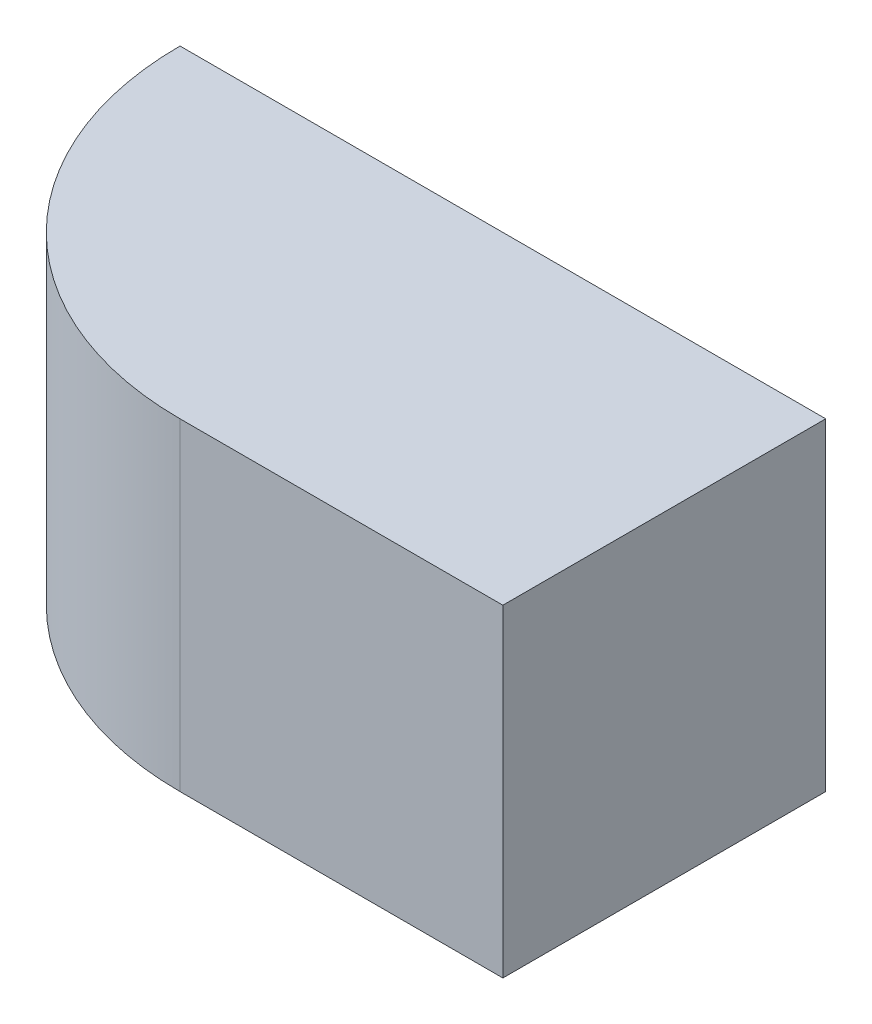
ISO-10303-21;
HEADER;
FILE_DESCRIPTION(('STEP AP214'),'2;1');
FILE_NAME('part.step','',(''),(''),'','','');
FILE_SCHEMA(('AUTOMOTIVE_DESIGN { 1 0 10303 214 1 1 1 1 }'));
ENDSEC;
DATA;
#1=APPLICATION_CONTEXT('core data for automotive mechanical design processes');
#2=APPLICATION_PROTOCOL_DEFINITION('international standard','automotive_design',2000,#1);
#3=PRODUCT_CONTEXT('',#1,'mechanical');
#4=PRODUCT('Part','Part','',(#3));
#5=PRODUCT_RELATED_PRODUCT_CATEGORY('part','',(#4));
#6=PRODUCT_DEFINITION_FORMATION('','',#4);
#7=PRODUCT_DEFINITION_CONTEXT('part definition',#1,'design');
#8=PRODUCT_DEFINITION('design','',#6,#7);
#9=PRODUCT_DEFINITION_SHAPE('','',#8);
#10=(LENGTH_UNIT() NAMED_UNIT(*) SI_UNIT(.MILLI.,.METRE.));
#11=(NAMED_UNIT(*) PLANE_ANGLE_UNIT() SI_UNIT($,.RADIAN.));
#12=(NAMED_UNIT(*) SI_UNIT($,.STERADIAN.) SOLID_ANGLE_UNIT());
#13=UNCERTAINTY_MEASURE_WITH_UNIT(LENGTH_MEASURE(1.E-05),#10,'distance_accuracy_value','');
#14=(GEOMETRIC_REPRESENTATION_CONTEXT(3) GLOBAL_UNCERTAINTY_ASSIGNED_CONTEXT((#13)) GLOBAL_UNIT_ASSIGNED_CONTEXT((#10,
#11,#12)) REPRESENTATION_CONTEXT('',''));
#15=CARTESIAN_POINT('',(0.,0.,0.));
#16=DIRECTION('',(0.,0.,1.));
#17=DIRECTION('',(1.,0.,0.));
#18=AXIS2_PLACEMENT_3D('',#15,#16,#17);
#19=CARTESIAN_POINT('',(-2.00000002980232,-1.75000013038516,2.));
#20=DIRECTION('',(0.,0.,1.));
#21=DIRECTION('',(1.,0.,0.));
#22=AXIS2_PLACEMENT_3D('',#19,#20,#21);
#23=PLANE('',#22);
#24=DIRECTION('',(-1.,0.,0.));
#25=VECTOR('',#24,1.);
#26=CARTESIAN_POINT('',(-1.50000002235174,-2.00000013411045,2.));
#27=LINE('',#26,#25);
#28=CARTESIAN_POINT('',(-1.50000002235174,-2.00000013411045,2.));
#29=VERTEX_POINT('',#28);
#30=CARTESIAN_POINT('',(-2.5000000372529,-2.00000013411045,2.));
#31=VERTEX_POINT('',#30);
#32=EDGE_CURVE('E74',#29,#31,#27,.T.);
#33=ORIENTED_EDGE('',*,*,#32,.T.);
#34=DIRECTION('',(0.,1.,0.));
#35=VECTOR('',#34,1.);
#36=CARTESIAN_POINT('',(-2.5000000372529,-2.00000013411045,2.));
#37=LINE('',#36,#35);
#38=CARTESIAN_POINT('',(-2.5000000372529,-1.50000012665987,2.));
#39=VERTEX_POINT('',#38);
#40=EDGE_CURVE('E76',#31,#39,#37,.T.);
#41=ORIENTED_EDGE('',*,*,#40,.T.);
#42=DIRECTION('',(1.,0.,0.));
#43=VECTOR('',#42,1.);
#44=CARTESIAN_POINT('',(-2.5000000372529,-1.50000012665987,2.));
#45=LINE('',#44,#43);
#46=CARTESIAN_POINT('',(-1.50000002235174,-1.50000012665987,2.));
#47=VERTEX_POINT('',#46);
#48=EDGE_CURVE('E98',#39,#47,#45,.T.);
#49=ORIENTED_EDGE('',*,*,#48,.T.);
#50=DIRECTION('',(0.,-1.,0.));
#51=VECTOR('',#50,1.);
#52=CARTESIAN_POINT('',(-1.50000002235174,-1.50000012665987,2.));
#53=LINE('',#52,#51);
#54=EDGE_CURVE('E28',#47,#29,#53,.T.);
#55=ORIENTED_EDGE('',*,*,#54,.T.);
#56=EDGE_LOOP('',(#33,#41,#49,#55));
#57=FACE_BOUND('',#56,.T.);
#58=ADVANCED_FACE('F17',(#57),#23,.F.);
#59=CARTESIAN_POINT('',(-2.00000002980232,-1.75000013038516,2.5));
#60=DIRECTION('',(0.,0.,1.));
#61=DIRECTION('',(1.,0.,0.));
#62=AXIS2_PLACEMENT_3D('',#59,#60,#61);
#63=PLANE('',#62);
#64=DIRECTION('',(0.,1.,0.));
#65=VECTOR('',#64,1.);
#66=CARTESIAN_POINT('',(-2.0000000372529,-1.62500012852251,2.5));
#67=LINE('',#66,#65);
#68=CARTESIAN_POINT('',(-2.0000000372529,-2.00000013411045,2.5));
#69=VERTEX_POINT('',#68);
#70=CARTESIAN_POINT('',(-2.0000000372529,-1.50000012665987,2.5));
#71=VERTEX_POINT('',#70);
#72=EDGE_CURVE('E91',#69,#71,#67,.T.);
#73=ORIENTED_EDGE('',*,*,#72,.F.);
#74=DIRECTION('',(1.,0.,0.));
#75=VECTOR('',#74,1.);
#76=CARTESIAN_POINT('',(-1.50000002235174,-2.00000013411045,2.5));
#77=LINE('',#76,#75);
#78=CARTESIAN_POINT('',(-1.50000002235174,-2.00000013411045,2.5));
#79=VERTEX_POINT('',#78);
#80=EDGE_CURVE('E21',#69,#79,#77,.T.);
#81=ORIENTED_EDGE('',*,*,#80,.T.);
#82=DIRECTION('',(0.,1.,0.));
#83=VECTOR('',#82,1.);
#84=CARTESIAN_POINT('',(-1.50000002235174,-1.50000012665987,2.5));
#85=LINE('',#84,#83);
#86=CARTESIAN_POINT('',(-1.50000002235174,-1.50000012665987,2.5));
#87=VERTEX_POINT('',#86);
#88=EDGE_CURVE('E11',#79,#87,#85,.T.);
#89=ORIENTED_EDGE('',*,*,#88,.T.);
#90=DIRECTION('',(-1.,0.,0.));
#91=VECTOR('',#90,1.);
#92=CARTESIAN_POINT('',(-2.5000000372529,-1.50000012665987,2.5));
#93=LINE('',#92,#91);
#94=EDGE_CURVE('E103',#87,#71,#93,.T.);
#95=ORIENTED_EDGE('',*,*,#94,.T.);
#96=EDGE_LOOP('',(#73,#81,#89,#95));
#97=FACE_BOUND('',#96,.T.);
#98=ADVANCED_FACE('F116',(#97),#63,.T.);
#99=CARTESIAN_POINT('',(-1.50000002235174,-2.00000013411045,2.));
#100=DIRECTION('',(1.,0.,0.));
#101=DIRECTION('',(0.,1.,0.));
#102=AXIS2_PLACEMENT_3D('',#99,#100,#101);
#103=PLANE('',#102);
#104=ORIENTED_EDGE('',*,*,#54,.F.);
#105=DIRECTION('',(0.,0.,1.));
#106=VECTOR('',#105,1.);
#107=CARTESIAN_POINT('',(-1.50000002235174,-1.50000012665987,2.));
#108=LINE('',#107,#106);
#109=EDGE_CURVE('E100',#47,#87,#108,.T.);
#110=ORIENTED_EDGE('',*,*,#109,.T.);
#111=ORIENTED_EDGE('',*,*,#88,.F.);
#112=DIRECTION('',(0.,0.,1.));
#113=VECTOR('',#112,1.);
#114=CARTESIAN_POINT('',(-1.50000002235174,-2.00000013411045,2.));
#115=LINE('',#114,#113);
#116=EDGE_CURVE('E79',#29,#79,#115,.T.);
#117=ORIENTED_EDGE('',*,*,#116,.F.);
#118=EDGE_LOOP('',(#104,#110,#111,#117));
#119=FACE_BOUND('',#118,.T.);
#120=ADVANCED_FACE('F114',(#119),#103,.T.);
#121=CARTESIAN_POINT('',(-1.50000002235174,-1.50000012665987,2.));
#122=DIRECTION('',(0.,1.,0.));
#123=DIRECTION('',(1.,0.,0.));
#124=AXIS2_PLACEMENT_3D('',#121,#122,#123);
#125=PLANE('',#124);
#126=CARTESIAN_POINT('',(-2.0000000372529,-1.50000012665987,2.));
#127=DIRECTION('',(0.,-1.,0.));
#128=DIRECTION('',(-0.707106781186548,0.,0.707106781186548));
#129=AXIS2_PLACEMENT_3D('',#126,#127,#128);
#130=CIRCLE('',#129,0.5);
#131=EDGE_CURVE('E86',#71,#39,#130,.T.);
#132=ORIENTED_EDGE('',*,*,#131,.F.);
#133=ORIENTED_EDGE('',*,*,#94,.F.);
#134=ORIENTED_EDGE('',*,*,#109,.F.);
#135=ORIENTED_EDGE('',*,*,#48,.F.);
#136=EDGE_LOOP('',(#132,#133,#134,#135));
#137=FACE_BOUND('',#136,.T.);
#138=ADVANCED_FACE('F113',(#137),#125,.T.);
#139=CARTESIAN_POINT('',(-2.5000000372529,-2.00000013411045,2.));
#140=DIRECTION('',(0.,-1.,0.));
#141=DIRECTION('',(0.,0.,-1.));
#142=AXIS2_PLACEMENT_3D('',#139,#140,#141);
#143=PLANE('',#142);
#144=CARTESIAN_POINT('',(-2.0000000372529,-2.00000013411045,2.));
#145=DIRECTION('',(0.,1.,0.));
#146=DIRECTION('',(-0.707106781186548,0.,0.707106781186548));
#147=AXIS2_PLACEMENT_3D('',#144,#145,#146);
#148=CIRCLE('',#147,0.5);
#149=EDGE_CURVE('E84',#31,#69,#148,.T.);
#150=ORIENTED_EDGE('',*,*,#149,.F.);
#151=ORIENTED_EDGE('',*,*,#32,.F.);
#152=ORIENTED_EDGE('',*,*,#116,.T.);
#153=ORIENTED_EDGE('',*,*,#80,.F.);
#154=EDGE_LOOP('',(#150,#151,#152,#153));
#155=FACE_BOUND('',#154,.T.);
#156=ADVANCED_FACE('F89',(#155),#143,.T.);
#157=CARTESIAN_POINT('',(-2.0000000372529,-1.62500012852251,2.));
#158=DIRECTION('',(0.,-1.,0.));
#159=DIRECTION('',(-0.707106781186548,0.,0.707106781186548));
#160=AXIS2_PLACEMENT_3D('',#157,#158,#159);
#161=CYLINDRICAL_SURFACE('',#160,0.5);
#162=ORIENTED_EDGE('',*,*,#149,.T.);
#163=ORIENTED_EDGE('',*,*,#72,.T.);
#164=ORIENTED_EDGE('',*,*,#131,.T.);
#165=ORIENTED_EDGE('',*,*,#40,.F.);
#166=EDGE_LOOP('',(#162,#163,#164,#165));
#167=FACE_BOUND('',#166,.T.);
#168=ADVANCED_FACE('F19',(#167),#161,.T.);
#169=CLOSED_SHELL('',(#58,#98,#120,#138,#156,#168));
#170=MANIFOLD_SOLID_BREP('B1',#169);
#171=ADVANCED_BREP_SHAPE_REPRESENTATION('',(#18,#170),#14);
#172=SHAPE_DEFINITION_REPRESENTATION(#9,#171);
ENDSEC;
END-ISO-10303-21;
